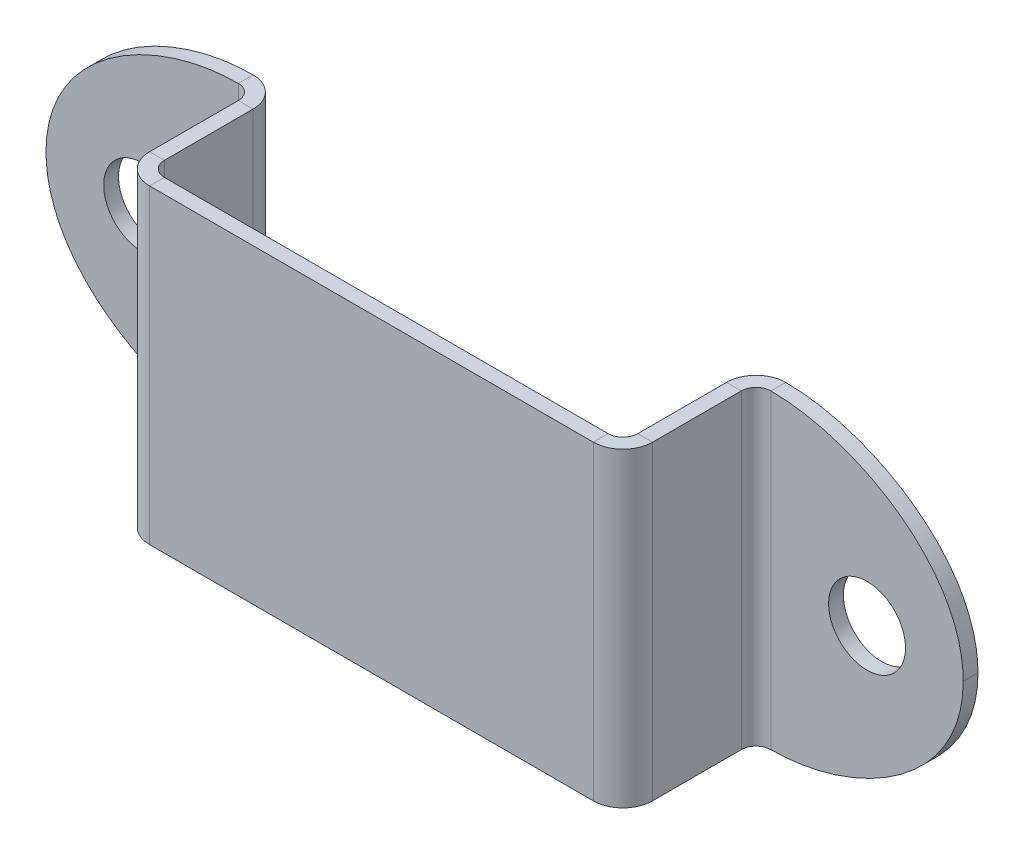
ISO-10303-21;
HEADER;
FILE_DESCRIPTION(('STEP AP214'),'2;1');
FILE_NAME('part.step','',(''),(''),'','','');
FILE_SCHEMA(('AUTOMOTIVE_DESIGN { 1 0 10303 214 1 1 1 1 }'));
ENDSEC;
DATA;
#1=APPLICATION_CONTEXT('core data for automotive mechanical design processes');
#2=APPLICATION_PROTOCOL_DEFINITION('international standard','automotive_design',2000,#1);
#3=PRODUCT_CONTEXT('',#1,'mechanical');
#4=PRODUCT('Part','Part','',(#3));
#5=PRODUCT_RELATED_PRODUCT_CATEGORY('part','',(#4));
#6=PRODUCT_DEFINITION_FORMATION('','',#4);
#7=PRODUCT_DEFINITION_CONTEXT('part definition',#1,'design');
#8=PRODUCT_DEFINITION('design','',#6,#7);
#9=PRODUCT_DEFINITION_SHAPE('','',#8);
#10=(LENGTH_UNIT() NAMED_UNIT(*) SI_UNIT(.MILLI.,.METRE.));
#11=(NAMED_UNIT(*) PLANE_ANGLE_UNIT() SI_UNIT($,.RADIAN.));
#12=(NAMED_UNIT(*) SI_UNIT($,.STERADIAN.) SOLID_ANGLE_UNIT());
#13=UNCERTAINTY_MEASURE_WITH_UNIT(LENGTH_MEASURE(1.E-05),#10,'distance_accuracy_value','');
#14=(GEOMETRIC_REPRESENTATION_CONTEXT(3) GLOBAL_UNCERTAINTY_ASSIGNED_CONTEXT((#13)) GLOBAL_UNIT_ASSIGNED_CONTEXT((#10,
#11,#12)) REPRESENTATION_CONTEXT('',''));
#15=CARTESIAN_POINT('',(0.,0.,0.));
#16=DIRECTION('',(0.,0.,1.));
#17=DIRECTION('',(1.,0.,0.));
#18=AXIS2_PLACEMENT_3D('',#15,#16,#17);
#19=CARTESIAN_POINT('',(16.,21.,1.));
#20=DIRECTION('',(0.,0.,-1.));
#21=DIRECTION('',(-1.,0.,0.));
#22=AXIS2_PLACEMENT_3D('',#19,#20,#21);
#23=PLANE('',#22);
#24=CARTESIAN_POINT('',(24.5,10.5,1.00000000000001));
#25=DIRECTION('',(0.,0.,1.));
#26=DIRECTION('',(-1.,0.,0.));
#27=AXIS2_PLACEMENT_3D('',#24,#25,#26);
#28=CIRCLE('',#27,2.6);
#29=CARTESIAN_POINT('',(21.9,10.5,1.00000000000001));
#30=VERTEX_POINT('',#29);
#31=EDGE_CURVE('E1026',#30,#30,#28,.T.);
#32=ORIENTED_EDGE('',*,*,#31,.F.);
#33=EDGE_LOOP('',(#32));
#34=FACE_BOUND('',#33,.T.);
#35=CARTESIAN_POINT('',(18.,21.,1.00000000000001));
#36=CARTESIAN_POINT('',(23.8406079071876,21.,1.00000000000001));
#37=CARTESIAN_POINT('',(31.,16.8315231890878,1.00000000000001));
#38=CARTESIAN_POINT('',(31.,10.5,1.00000000000001));
#39=B_SPLINE_CURVE_WITH_KNOTS('',3,(#35,#36,#37,#38),.UNSPECIFIED.,.F.,.F.,(4,4),(0.,1.),.UNSPECIFIED.);
#40=CARTESIAN_POINT('',(18.,21.,1.00000000000001));
#41=VERTEX_POINT('',#40);
#42=CARTESIAN_POINT('',(31.,10.5,1.00000000000001));
#43=VERTEX_POINT('',#42);
#44=EDGE_CURVE('E512',#41,#43,#39,.T.);
#45=ORIENTED_EDGE('',*,*,#44,.F.);
#46=DIRECTION('',(0.,-1.,0.));
#47=VECTOR('',#46,1.);
#48=CARTESIAN_POINT('',(18.,21.,0.999999999999999));
#49=LINE('',#48,#47);
#50=CARTESIAN_POINT('',(18.,0.,0.999999999999999));
#51=VERTEX_POINT('',#50);
#52=EDGE_CURVE('E219',#41,#51,#49,.T.);
#53=ORIENTED_EDGE('',*,*,#52,.T.);
#54=CARTESIAN_POINT('',(31.,10.5,1.00000000000001));
#55=CARTESIAN_POINT('',(31.,4.16847681091217,1.00000000000001));
#56=CARTESIAN_POINT('',(23.8406079071876,0.,1.00000000000001));
#57=CARTESIAN_POINT('',(18.,0.,1.00000000000001));
#58=B_SPLINE_CURVE_WITH_KNOTS('',3,(#54,#55,#56,#57),.UNSPECIFIED.,.F.,.F.,(4,4),(0.,1.),.UNSPECIFIED.);
#59=EDGE_CURVE('E128',#43,#51,#58,.T.);
#60=ORIENTED_EDGE('',*,*,#59,.F.);
#61=EDGE_LOOP('',(#45,#53,#60));
#62=FACE_BOUND('',#61,.T.);
#63=ADVANCED_FACE('F54',(#34,#62),#23,.F.);
#64=CARTESIAN_POINT('',(16.,21.,0.));
#65=DIRECTION('',(0.,0.,-1.));
#66=DIRECTION('',(-1.,0.,0.));
#67=AXIS2_PLACEMENT_3D('',#64,#65,#66);
#68=PLANE('',#67);
#69=CARTESIAN_POINT('',(24.5,10.5,0.));
#70=DIRECTION('',(0.,0.,1.));
#71=DIRECTION('',(-1.,0.,0.));
#72=AXIS2_PLACEMENT_3D('',#69,#70,#71);
#73=CIRCLE('',#72,2.6);
#74=CARTESIAN_POINT('',(21.9,10.5,0.));
#75=VERTEX_POINT('',#74);
#76=EDGE_CURVE('E1027',#75,#75,#73,.T.);
#77=ORIENTED_EDGE('',*,*,#76,.T.);
#78=EDGE_LOOP('',(#77));
#79=FACE_BOUND('',#78,.T.);
#80=DIRECTION('',(0.,-1.,0.));
#81=VECTOR('',#80,1.);
#82=CARTESIAN_POINT('',(18.,21.,0.));
#83=LINE('',#82,#81);
#84=CARTESIAN_POINT('',(18.,21.,0.));
#85=VERTEX_POINT('',#84);
#86=CARTESIAN_POINT('',(18.,0.,0.));
#87=VERTEX_POINT('',#86);
#88=EDGE_CURVE('E324',#85,#87,#83,.T.);
#89=ORIENTED_EDGE('',*,*,#88,.F.);
#90=CARTESIAN_POINT('',(18.,21.,0.));
#91=CARTESIAN_POINT('',(23.8406079071876,21.,0.));
#92=CARTESIAN_POINT('',(31.,16.8315231890878,0.));
#93=CARTESIAN_POINT('',(31.,10.5,0.));
#94=B_SPLINE_CURVE_WITH_KNOTS('',3,(#90,#91,#92,#93),.UNSPECIFIED.,.F.,.F.,(4,4),(0.,1.),.UNSPECIFIED.);
#95=CARTESIAN_POINT('',(31.,10.5,0.));
#96=VERTEX_POINT('',#95);
#97=EDGE_CURVE('E514',#85,#96,#94,.T.);
#98=ORIENTED_EDGE('',*,*,#97,.T.);
#99=CARTESIAN_POINT('',(31.,10.5,0.));
#100=CARTESIAN_POINT('',(31.,4.16847681091217,0.));
#101=CARTESIAN_POINT('',(23.8406079071876,0.,0.));
#102=CARTESIAN_POINT('',(18.,0.,0.));
#103=B_SPLINE_CURVE_WITH_KNOTS('',3,(#99,#100,#101,#102),.UNSPECIFIED.,.F.,.F.,(4,4),(0.,1.),.UNSPECIFIED.);
#104=EDGE_CURVE('E529',#96,#87,#103,.T.);
#105=ORIENTED_EDGE('',*,*,#104,.T.);
#106=EDGE_LOOP('',(#89,#98,#105));
#107=FACE_BOUND('',#106,.T.);
#108=ADVANCED_FACE('F531',(#79,#107),#68,.T.);
#109=CARTESIAN_POINT('',(-31.,21.,0.));
#110=DIRECTION('',(0.,0.,-1.));
#111=DIRECTION('',(-1.,0.,0.));
#112=AXIS2_PLACEMENT_3D('',#109,#110,#111);
#113=PLANE('',#112);
#114=CARTESIAN_POINT('',(-24.5,10.5,0.));
#115=DIRECTION('',(0.,0.,1.));
#116=DIRECTION('',(1.,0.,0.));
#117=AXIS2_PLACEMENT_3D('',#114,#115,#116);
#118=CIRCLE('',#117,2.6);
#119=CARTESIAN_POINT('',(-21.9,10.5,0.));
#120=VERTEX_POINT('',#119);
#121=EDGE_CURVE('E225',#120,#120,#118,.T.);
#122=ORIENTED_EDGE('',*,*,#121,.T.);
#123=EDGE_LOOP('',(#122));
#124=FACE_BOUND('',#123,.T.);
#125=CARTESIAN_POINT('',(-18.,0.,0.));
#126=CARTESIAN_POINT('',(-23.8406079071876,0.,0.));
#127=CARTESIAN_POINT('',(-31.,4.16847681091217,0.));
#128=CARTESIAN_POINT('',(-31.,10.5,0.));
#129=B_SPLINE_CURVE_WITH_KNOTS('',3,(#125,#126,#127,#128),.UNSPECIFIED.,.F.,.F.,(4,4),(0.,1.),.UNSPECIFIED.);
#130=CARTESIAN_POINT('',(-18.,0.,0.));
#131=VERTEX_POINT('',#130);
#132=CARTESIAN_POINT('',(-31.,10.5,0.));
#133=VERTEX_POINT('',#132);
#134=EDGE_CURVE('E390',#131,#133,#129,.T.);
#135=ORIENTED_EDGE('',*,*,#134,.T.);
#136=CARTESIAN_POINT('',(-31.,10.5,0.));
#137=CARTESIAN_POINT('',(-31.,16.8315231890878,0.));
#138=CARTESIAN_POINT('',(-23.8406079071876,21.,0.));
#139=CARTESIAN_POINT('',(-18.,21.,0.));
#140=B_SPLINE_CURVE_WITH_KNOTS('',3,(#136,#137,#138,#139),.UNSPECIFIED.,.F.,.F.,(4,4),(0.,1.),.UNSPECIFIED.);
#141=CARTESIAN_POINT('',(-18.,21.,0.));
#142=VERTEX_POINT('',#141);
#143=EDGE_CURVE('E374',#133,#142,#140,.T.);
#144=ORIENTED_EDGE('',*,*,#143,.T.);
#145=DIRECTION('',(0.,-1.,0.));
#146=VECTOR('',#145,1.);
#147=CARTESIAN_POINT('',(-18.,21.,0.));
#148=LINE('',#147,#146);
#149=EDGE_CURVE('E296',#142,#131,#148,.T.);
#150=ORIENTED_EDGE('',*,*,#149,.T.);
#151=EDGE_LOOP('',(#135,#144,#150));
#152=FACE_BOUND('',#151,.T.);
#153=ADVANCED_FACE('F387',(#124,#152),#113,.T.);
#154=CARTESIAN_POINT('',(-31.,21.,1.));
#155=DIRECTION('',(0.,0.,-1.));
#156=DIRECTION('',(-1.,0.,0.));
#157=AXIS2_PLACEMENT_3D('',#154,#155,#156);
#158=PLANE('',#157);
#159=CARTESIAN_POINT('',(-24.5,10.5,1.00000000000001));
#160=DIRECTION('',(0.,0.,1.));
#161=DIRECTION('',(1.,0.,0.));
#162=AXIS2_PLACEMENT_3D('',#159,#160,#161);
#163=CIRCLE('',#162,2.6);
#164=CARTESIAN_POINT('',(-21.9,10.5,1.00000000000001));
#165=VERTEX_POINT('',#164);
#166=EDGE_CURVE('E1031',#165,#165,#163,.T.);
#167=ORIENTED_EDGE('',*,*,#166,.F.);
#168=EDGE_LOOP('',(#167));
#169=FACE_BOUND('',#168,.T.);
#170=CARTESIAN_POINT('',(-31.,10.5,1.00000000000001));
#171=CARTESIAN_POINT('',(-31.,16.8315231890878,1.00000000000001));
#172=CARTESIAN_POINT('',(-23.8406079071876,21.,1.00000000000001));
#173=CARTESIAN_POINT('',(-18.,21.,1.00000000000001));
#174=B_SPLINE_CURVE_WITH_KNOTS('',3,(#170,#171,#172,#173),.UNSPECIFIED.,.F.,.F.,(4,4),(0.,1.),.UNSPECIFIED.);
#175=CARTESIAN_POINT('',(-31.,10.5,1.00000000000001));
#176=VERTEX_POINT('',#175);
#177=CARTESIAN_POINT('',(-18.,21.,1.));
#178=VERTEX_POINT('',#177);
#179=EDGE_CURVE('E378',#176,#178,#174,.T.);
#180=ORIENTED_EDGE('',*,*,#179,.F.);
#181=CARTESIAN_POINT('',(-18.,0.,1.00000000000001));
#182=CARTESIAN_POINT('',(-23.8406079071876,0.,1.00000000000001));
#183=CARTESIAN_POINT('',(-31.,4.16847681091217,1.00000000000001));
#184=CARTESIAN_POINT('',(-31.,10.5,1.00000000000001));
#185=B_SPLINE_CURVE_WITH_KNOTS('',3,(#181,#182,#183,#184),.UNSPECIFIED.,.F.,.F.,(4,4),(0.,1.),.UNSPECIFIED.);
#186=CARTESIAN_POINT('',(-18.,0.,1.));
#187=VERTEX_POINT('',#186);
#188=EDGE_CURVE('E484',#187,#176,#185,.T.);
#189=ORIENTED_EDGE('',*,*,#188,.F.);
#190=DIRECTION('',(0.,-1.,0.));
#191=VECTOR('',#190,1.);
#192=CARTESIAN_POINT('',(-18.,21.,1.));
#193=LINE('',#192,#191);
#194=EDGE_CURVE('E292',#178,#187,#193,.T.);
#195=ORIENTED_EDGE('',*,*,#194,.F.);
#196=EDGE_LOOP('',(#180,#189,#195));
#197=FACE_BOUND('',#196,.T.);
#198=ADVANCED_FACE('F486',(#169,#197),#158,.F.);
#199=CARTESIAN_POINT('',(-16.,21.,2.));
#200=DIRECTION('',(0.,1.,0.));
#201=DIRECTION('',(0.,0.,1.));
#202=AXIS2_PLACEMENT_3D('',#199,#200,#201);
#203=PLANE('',#202);
#204=DIRECTION('',(-1.,0.,0.));
#205=VECTOR('',#204,1.);
#206=CARTESIAN_POINT('',(-16.,21.,2.));
#207=LINE('',#206,#205);
#208=CARTESIAN_POINT('',(-16.,21.,2.));
#209=VERTEX_POINT('',#208);
#210=CARTESIAN_POINT('',(-17.,21.,2.));
#211=VERTEX_POINT('',#210);
#212=EDGE_CURVE('E13',#209,#211,#207,.T.);
#213=ORIENTED_EDGE('',*,*,#212,.F.);
#214=CARTESIAN_POINT('',(-18.,21.,2.));
#215=DIRECTION('',(0.,1.,0.));
#216=DIRECTION('',(0.,0.,1.));
#217=AXIS2_PLACEMENT_3D('',#214,#215,#216);
#218=CIRCLE('',#217,2.);
#219=EDGE_CURVE('E397',#142,#209,#218,.F.);
#220=ORIENTED_EDGE('',*,*,#219,.F.);
#221=DIRECTION('',(0.,0.,-1.));
#222=VECTOR('',#221,1.);
#223=CARTESIAN_POINT('',(-18.,21.,1.));
#224=LINE('',#223,#222);
#225=EDGE_CURVE('E64',#178,#142,#224,.T.);
#226=ORIENTED_EDGE('',*,*,#225,.F.);
#227=CARTESIAN_POINT('',(-18.,21.,2.));
#228=DIRECTION('',(0.,1.,0.));
#229=DIRECTION('',(1.,0.,0.));
#230=AXIS2_PLACEMENT_3D('',#227,#228,#229);
#231=CIRCLE('',#230,1.);
#232=EDGE_CURVE('E399',#178,#211,#231,.F.);
#233=ORIENTED_EDGE('',*,*,#232,.T.);
#234=EDGE_LOOP('',(#213,#220,#226,#233));
#235=FACE_BOUND('',#234,.T.);
#236=ADVANCED_FACE('F56',(#235),#203,.T.);
#237=CARTESIAN_POINT('',(-18.,21.,1.));
#238=DIRECTION('',(0.,1.,0.));
#239=DIRECTION('',(0.,0.,1.));
#240=AXIS2_PLACEMENT_3D('',#237,#238,#239);
#241=PLANE('',#240);
#242=DIRECTION('',(0.,0.,1.));
#243=VECTOR('',#242,1.);
#244=CARTESIAN_POINT('',(-16.,21.,0.));
#245=LINE('',#244,#243);
#246=CARTESIAN_POINT('',(-16.,21.,8.00000000000001));
#247=VERTEX_POINT('',#246);
#248=EDGE_CURVE('E400',#209,#247,#245,.T.);
#249=ORIENTED_EDGE('',*,*,#248,.F.);
#250=ORIENTED_EDGE('',*,*,#212,.T.);
#251=DIRECTION('',(0.,0.,-1.));
#252=VECTOR('',#251,1.);
#253=CARTESIAN_POINT('',(-17.,21.,0.));
#254=LINE('',#253,#252);
#255=CARTESIAN_POINT('',(-17.,21.,8.00000000000001));
#256=VERTEX_POINT('',#255);
#257=EDGE_CURVE('E402',#211,#256,#254,.F.);
#258=ORIENTED_EDGE('',*,*,#257,.T.);
#259=DIRECTION('',(1.,0.,0.));
#260=VECTOR('',#259,1.);
#261=CARTESIAN_POINT('',(-17.,21.,8.00000000000001));
#262=LINE('',#261,#260);
#263=EDGE_CURVE('E352',#256,#247,#262,.T.);
#264=ORIENTED_EDGE('',*,*,#263,.T.);
#265=EDGE_LOOP('',(#249,#250,#258,#264));
#266=FACE_BOUND('',#265,.T.);
#267=ADVANCED_FACE('F465',(#266),#241,.T.);
#268=CARTESIAN_POINT('',(-18.,0.,0.));
#269=DIRECTION('',(0.,-1.,0.));
#270=DIRECTION('',(0.,0.,-1.));
#271=AXIS2_PLACEMENT_3D('',#268,#269,#270);
#272=PLANE('',#271);
#273=DIRECTION('',(0.,0.,1.));
#274=VECTOR('',#273,1.);
#275=CARTESIAN_POINT('',(-18.,0.,0.));
#276=LINE('',#275,#274);
#277=EDGE_CURVE('E360',#131,#187,#276,.T.);
#278=ORIENTED_EDGE('',*,*,#277,.F.);
#279=CARTESIAN_POINT('',(-18.,0.,2.));
#280=DIRECTION('',(0.,1.,0.));
#281=DIRECTION('',(0.,0.,1.));
#282=AXIS2_PLACEMENT_3D('',#279,#280,#281);
#283=CIRCLE('',#282,2.);
#284=CARTESIAN_POINT('',(-16.,0.,2.));
#285=VERTEX_POINT('',#284);
#286=EDGE_CURVE('E244',#131,#285,#283,.F.);
#287=ORIENTED_EDGE('',*,*,#286,.T.);
#288=DIRECTION('',(1.,0.,0.));
#289=VECTOR('',#288,1.);
#290=CARTESIAN_POINT('',(-17.,0.,2.));
#291=LINE('',#290,#289);
#292=CARTESIAN_POINT('',(-17.,0.,2.));
#293=VERTEX_POINT('',#292);
#294=EDGE_CURVE('E357',#293,#285,#291,.T.);
#295=ORIENTED_EDGE('',*,*,#294,.F.);
#296=CARTESIAN_POINT('',(-18.,0.,2.));
#297=DIRECTION('',(0.,1.,0.));
#298=DIRECTION('',(1.,0.,0.));
#299=AXIS2_PLACEMENT_3D('',#296,#297,#298);
#300=CIRCLE('',#299,1.);
#301=EDGE_CURVE('E248',#187,#293,#300,.F.);
#302=ORIENTED_EDGE('',*,*,#301,.F.);
#303=EDGE_LOOP('',(#278,#287,#295,#302));
#304=FACE_BOUND('',#303,.T.);
#305=ADVANCED_FACE('F477',(#304),#272,.T.);
#306=CARTESIAN_POINT('',(-15.,21.,9.00000000000001));
#307=DIRECTION('',(0.,1.,0.));
#308=DIRECTION('',(0.,0.,1.));
#309=AXIS2_PLACEMENT_3D('',#306,#307,#308);
#310=PLANE('',#309);
#311=DIRECTION('',(0.,0.,1.));
#312=VECTOR('',#311,1.);
#313=CARTESIAN_POINT('',(-15.,21.,9.00000000000001));
#314=LINE('',#313,#312);
#315=CARTESIAN_POINT('',(-15.,21.,9.00000000000001));
#316=VERTEX_POINT('',#315);
#317=CARTESIAN_POINT('',(-15.,21.,10.));
#318=VERTEX_POINT('',#317);
#319=EDGE_CURVE('E184',#316,#318,#314,.T.);
#320=ORIENTED_EDGE('',*,*,#319,.F.);
#321=CARTESIAN_POINT('',(-15.,21.,8.00000000000001));
#322=DIRECTION('',(0.,-1.,0.));
#323=DIRECTION('',(0.,0.,-1.));
#324=AXIS2_PLACEMENT_3D('',#321,#322,#323);
#325=CIRCLE('',#324,1.);
#326=EDGE_CURVE('E406',#247,#316,#325,.F.);
#327=ORIENTED_EDGE('',*,*,#326,.F.);
#328=ORIENTED_EDGE('',*,*,#263,.F.);
#329=CARTESIAN_POINT('',(-15.,21.,8.00000000000001));
#330=DIRECTION('',(0.,1.,0.));
#331=DIRECTION('',(1.,0.,0.));
#332=AXIS2_PLACEMENT_3D('',#329,#330,#331);
#333=CIRCLE('',#332,2.);
#334=EDGE_CURVE('E189',#256,#318,#333,.T.);
#335=ORIENTED_EDGE('',*,*,#334,.T.);
#336=EDGE_LOOP('',(#320,#327,#328,#335));
#337=FACE_BOUND('',#336,.T.);
#338=ADVANCED_FACE('F418',(#337),#310,.T.);
#339=CARTESIAN_POINT('',(-17.,21.,8.00000000000001));
#340=DIRECTION('',(0.,1.,0.));
#341=DIRECTION('',(0.,0.,1.));
#342=AXIS2_PLACEMENT_3D('',#339,#340,#341);
#343=PLANE('',#342);
#344=DIRECTION('',(1.,0.,0.));
#345=VECTOR('',#344,1.);
#346=CARTESIAN_POINT('',(-16.,21.,9.00000000000001));
#347=LINE('',#346,#345);
#348=CARTESIAN_POINT('',(15.,21.,9.));
#349=VERTEX_POINT('',#348);
#350=EDGE_CURVE('E432',#316,#349,#347,.T.);
#351=ORIENTED_EDGE('',*,*,#350,.F.);
#352=ORIENTED_EDGE('',*,*,#319,.T.);
#353=DIRECTION('',(1.,0.,0.));
#354=VECTOR('',#353,1.);
#355=CARTESIAN_POINT('',(-16.,21.,10.));
#356=LINE('',#355,#354);
#357=CARTESIAN_POINT('',(15.,21.,10.));
#358=VERTEX_POINT('',#357);
#359=EDGE_CURVE('E181',#318,#358,#356,.T.);
#360=ORIENTED_EDGE('',*,*,#359,.T.);
#361=DIRECTION('',(0.,0.,-1.));
#362=VECTOR('',#361,1.);
#363=CARTESIAN_POINT('',(15.,21.,10.));
#364=LINE('',#363,#362);
#365=EDGE_CURVE('E164',#358,#349,#364,.T.);
#366=ORIENTED_EDGE('',*,*,#365,.T.);
#367=EDGE_LOOP('',(#351,#352,#360,#366));
#368=FACE_BOUND('',#367,.T.);
#369=ADVANCED_FACE('F183',(#368),#343,.T.);
#370=CARTESIAN_POINT('',(-16.,0.,8.00000000000001));
#371=DIRECTION('',(0.,-1.,0.));
#372=DIRECTION('',(0.,0.,-1.));
#373=AXIS2_PLACEMENT_3D('',#370,#371,#372);
#374=PLANE('',#373);
#375=DIRECTION('',(-1.,0.,0.));
#376=VECTOR('',#375,1.);
#377=CARTESIAN_POINT('',(-16.,0.,8.00000000000001));
#378=LINE('',#377,#376);
#379=CARTESIAN_POINT('',(-16.,0.,8.00000000000001));
#380=VERTEX_POINT('',#379);
#381=CARTESIAN_POINT('',(-17.,0.,8.00000000000001));
#382=VERTEX_POINT('',#381);
#383=EDGE_CURVE('E349',#380,#382,#378,.T.);
#384=ORIENTED_EDGE('',*,*,#383,.F.);
#385=CARTESIAN_POINT('',(-15.,0.,8.00000000000001));
#386=DIRECTION('',(0.,-1.,0.));
#387=DIRECTION('',(0.,0.,-1.));
#388=AXIS2_PLACEMENT_3D('',#385,#386,#387);
#389=CIRCLE('',#388,1.);
#390=CARTESIAN_POINT('',(-15.,0.,9.00000000000001));
#391=VERTEX_POINT('',#390);
#392=EDGE_CURVE('E236',#380,#391,#389,.F.);
#393=ORIENTED_EDGE('',*,*,#392,.T.);
#394=DIRECTION('',(0.,0.,-1.));
#395=VECTOR('',#394,1.);
#396=CARTESIAN_POINT('',(-15.,0.,10.));
#397=LINE('',#396,#395);
#398=CARTESIAN_POINT('',(-15.,0.,10.));
#399=VERTEX_POINT('',#398);
#400=EDGE_CURVE('E346',#399,#391,#397,.T.);
#401=ORIENTED_EDGE('',*,*,#400,.F.);
#402=CARTESIAN_POINT('',(-15.,0.,8.00000000000001));
#403=DIRECTION('',(0.,1.,0.));
#404=DIRECTION('',(1.,0.,0.));
#405=AXIS2_PLACEMENT_3D('',#402,#403,#404);
#406=CIRCLE('',#405,2.);
#407=EDGE_CURVE('E256',#382,#399,#406,.T.);
#408=ORIENTED_EDGE('',*,*,#407,.F.);
#409=EDGE_LOOP('',(#384,#393,#401,#408));
#410=FACE_BOUND('',#409,.T.);
#411=ADVANCED_FACE('F472',(#410),#374,.T.);
#412=CARTESIAN_POINT('',(-15.,0.,10.));
#413=DIRECTION('',(0.,-1.,0.));
#414=DIRECTION('',(0.,0.,-1.));
#415=AXIS2_PLACEMENT_3D('',#412,#413,#414);
#416=PLANE('',#415);
#417=DIRECTION('',(0.,0.,1.));
#418=VECTOR('',#417,1.);
#419=CARTESIAN_POINT('',(-16.,0.,0.));
#420=LINE('',#419,#418);
#421=EDGE_CURVE('E240',#285,#380,#420,.T.);
#422=ORIENTED_EDGE('',*,*,#421,.T.);
#423=ORIENTED_EDGE('',*,*,#383,.T.);
#424=DIRECTION('',(0.,0.,-1.));
#425=VECTOR('',#424,1.);
#426=CARTESIAN_POINT('',(-17.,0.,0.));
#427=LINE('',#426,#425);
#428=EDGE_CURVE('E252',#293,#382,#427,.F.);
#429=ORIENTED_EDGE('',*,*,#428,.F.);
#430=ORIENTED_EDGE('',*,*,#294,.T.);
#431=EDGE_LOOP('',(#422,#423,#429,#430));
#432=FACE_BOUND('',#431,.T.);
#433=ADVANCED_FACE('F474',(#432),#416,.T.);
#434=CARTESIAN_POINT('',(16.,21.,8.));
#435=DIRECTION('',(0.,1.,0.));
#436=DIRECTION('',(0.,0.,1.));
#437=AXIS2_PLACEMENT_3D('',#434,#435,#436);
#438=PLANE('',#437);
#439=DIRECTION('',(1.,0.,0.));
#440=VECTOR('',#439,1.);
#441=CARTESIAN_POINT('',(16.,21.,8.));
#442=LINE('',#441,#440);
#443=CARTESIAN_POINT('',(16.,21.,8.));
#444=VERTEX_POINT('',#443);
#445=CARTESIAN_POINT('',(17.,21.,8.));
#446=VERTEX_POINT('',#445);
#447=EDGE_CURVE('E177',#444,#446,#442,.T.);
#448=ORIENTED_EDGE('',*,*,#447,.F.);
#449=CARTESIAN_POINT('',(15.,21.,8.));
#450=DIRECTION('',(0.,-1.,0.));
#451=DIRECTION('',(0.,0.,-1.));
#452=AXIS2_PLACEMENT_3D('',#449,#450,#451);
#453=CIRCLE('',#452,1.);
#454=EDGE_CURVE('E171',#349,#444,#453,.F.);
#455=ORIENTED_EDGE('',*,*,#454,.F.);
#456=ORIENTED_EDGE('',*,*,#365,.F.);
#457=CARTESIAN_POINT('',(15.,21.,8.));
#458=DIRECTION('',(0.,1.,0.));
#459=DIRECTION('',(1.,0.,0.));
#460=AXIS2_PLACEMENT_3D('',#457,#458,#459);
#461=CIRCLE('',#460,2.);
#462=EDGE_CURVE('E168',#358,#446,#461,.T.);
#463=ORIENTED_EDGE('',*,*,#462,.T.);
#464=EDGE_LOOP('',(#448,#455,#456,#463));
#465=FACE_BOUND('',#464,.T.);
#466=ADVANCED_FACE('F166',(#465),#438,.T.);
#467=CARTESIAN_POINT('',(15.,21.,10.));
#468=DIRECTION('',(0.,1.,0.));
#469=DIRECTION('',(0.,0.,1.));
#470=AXIS2_PLACEMENT_3D('',#467,#468,#469);
#471=PLANE('',#470);
#472=DIRECTION('',(0.,0.,-1.));
#473=VECTOR('',#472,1.);
#474=CARTESIAN_POINT('',(16.,21.,9.));
#475=LINE('',#474,#473);
#476=CARTESIAN_POINT('',(16.,21.,2.));
#477=VERTEX_POINT('',#476);
#478=EDGE_CURVE('E447',#444,#477,#475,.T.);
#479=ORIENTED_EDGE('',*,*,#478,.F.);
#480=ORIENTED_EDGE('',*,*,#447,.T.);
#481=DIRECTION('',(0.,0.,-1.));
#482=VECTOR('',#481,1.);
#483=CARTESIAN_POINT('',(17.,21.,9.));
#484=LINE('',#483,#482);
#485=CARTESIAN_POINT('',(17.,21.,2.));
#486=VERTEX_POINT('',#485);
#487=EDGE_CURVE('E208',#446,#486,#484,.T.);
#488=ORIENTED_EDGE('',*,*,#487,.T.);
#489=DIRECTION('',(-1.,0.,0.));
#490=VECTOR('',#489,1.);
#491=CARTESIAN_POINT('',(17.,21.,2.));
#492=LINE('',#491,#490);
#493=EDGE_CURVE('E72',#486,#477,#492,.T.);
#494=ORIENTED_EDGE('',*,*,#493,.T.);
#495=EDGE_LOOP('',(#479,#480,#488,#494));
#496=FACE_BOUND('',#495,.T.);
#497=ADVANCED_FACE('F446',(#496),#471,.T.);
#498=CARTESIAN_POINT('',(15.,0.,9.));
#499=DIRECTION('',(0.,-1.,0.));
#500=DIRECTION('',(0.,0.,-1.));
#501=AXIS2_PLACEMENT_3D('',#498,#499,#500);
#502=PLANE('',#501);
#503=DIRECTION('',(0.,0.,1.));
#504=VECTOR('',#503,1.);
#505=CARTESIAN_POINT('',(15.,0.,9.));
#506=LINE('',#505,#504);
#507=CARTESIAN_POINT('',(15.,0.,9.));
#508=VERTEX_POINT('',#507);
#509=CARTESIAN_POINT('',(15.,0.,10.));
#510=VERTEX_POINT('',#509);
#511=EDGE_CURVE('E178',#508,#510,#506,.T.);
#512=ORIENTED_EDGE('',*,*,#511,.F.);
#513=CARTESIAN_POINT('',(15.,0.,8.));
#514=DIRECTION('',(0.,-1.,0.));
#515=DIRECTION('',(0.,0.,-1.));
#516=AXIS2_PLACEMENT_3D('',#513,#514,#515);
#517=CIRCLE('',#516,1.);
#518=CARTESIAN_POINT('',(16.,0.,8.));
#519=VERTEX_POINT('',#518);
#520=EDGE_CURVE('E228',#508,#519,#517,.F.);
#521=ORIENTED_EDGE('',*,*,#520,.T.);
#522=DIRECTION('',(-1.,0.,0.));
#523=VECTOR('',#522,1.);
#524=CARTESIAN_POINT('',(17.,0.,8.));
#525=LINE('',#524,#523);
#526=CARTESIAN_POINT('',(17.,0.,8.));
#527=VERTEX_POINT('',#526);
#528=EDGE_CURVE('E339',#527,#519,#525,.T.);
#529=ORIENTED_EDGE('',*,*,#528,.F.);
#530=CARTESIAN_POINT('',(15.,0.,8.));
#531=DIRECTION('',(0.,1.,0.));
#532=DIRECTION('',(1.,0.,0.));
#533=AXIS2_PLACEMENT_3D('',#530,#531,#532);
#534=CIRCLE('',#533,2.);
#535=EDGE_CURVE('E262',#510,#527,#534,.T.);
#536=ORIENTED_EDGE('',*,*,#535,.F.);
#537=EDGE_LOOP('',(#512,#521,#529,#536));
#538=FACE_BOUND('',#537,.T.);
#539=ADVANCED_FACE('F428',(#538),#502,.T.);
#540=CARTESIAN_POINT('',(17.,0.,8.));
#541=DIRECTION('',(0.,-1.,0.));
#542=DIRECTION('',(0.,0.,-1.));
#543=AXIS2_PLACEMENT_3D('',#540,#541,#542);
#544=PLANE('',#543);
#545=DIRECTION('',(1.,0.,0.));
#546=VECTOR('',#545,1.);
#547=CARTESIAN_POINT('',(-16.,0.,9.00000000000001));
#548=LINE('',#547,#546);
#549=EDGE_CURVE('E232',#391,#508,#548,.T.);
#550=ORIENTED_EDGE('',*,*,#549,.T.);
#551=ORIENTED_EDGE('',*,*,#511,.T.);
#552=DIRECTION('',(1.,0.,0.));
#553=VECTOR('',#552,1.);
#554=CARTESIAN_POINT('',(-16.,0.,10.));
#555=LINE('',#554,#553);
#556=EDGE_CURVE('E196',#399,#510,#555,.T.);
#557=ORIENTED_EDGE('',*,*,#556,.F.);
#558=ORIENTED_EDGE('',*,*,#400,.T.);
#559=EDGE_LOOP('',(#550,#551,#557,#558));
#560=FACE_BOUND('',#559,.T.);
#561=ADVANCED_FACE('F425',(#560),#544,.T.);
#562=CARTESIAN_POINT('',(18.,21.,0.));
#563=DIRECTION('',(0.,1.,0.));
#564=DIRECTION('',(0.,0.,1.));
#565=AXIS2_PLACEMENT_3D('',#562,#563,#564);
#566=PLANE('',#565);
#567=DIRECTION('',(0.,0.,1.));
#568=VECTOR('',#567,1.);
#569=CARTESIAN_POINT('',(18.,21.,0.));
#570=LINE('',#569,#568);
#571=EDGE_CURVE('E335',#85,#41,#570,.T.);
#572=ORIENTED_EDGE('',*,*,#571,.F.);
#573=CARTESIAN_POINT('',(18.,21.,2.));
#574=DIRECTION('',(0.,1.,0.));
#575=DIRECTION('',(0.,0.,1.));
#576=AXIS2_PLACEMENT_3D('',#573,#574,#575);
#577=CIRCLE('',#576,2.);
#578=EDGE_CURVE('E272',#477,#85,#577,.F.);
#579=ORIENTED_EDGE('',*,*,#578,.F.);
#580=ORIENTED_EDGE('',*,*,#493,.F.);
#581=CARTESIAN_POINT('',(18.,21.,2.));
#582=DIRECTION('',(0.,1.,0.));
#583=DIRECTION('',(1.,0.,0.));
#584=AXIS2_PLACEMENT_3D('',#581,#582,#583);
#585=CIRCLE('',#584,1.);
#586=EDGE_CURVE('E213',#486,#41,#585,.F.);
#587=ORIENTED_EDGE('',*,*,#586,.T.);
#588=EDGE_LOOP('',(#572,#579,#580,#587));
#589=FACE_BOUND('',#588,.T.);
#590=ADVANCED_FACE('F520',(#589),#566,.T.);
#591=CARTESIAN_POINT('',(16.,0.,2.));
#592=DIRECTION('',(0.,-1.,0.));
#593=DIRECTION('',(0.,0.,-1.));
#594=AXIS2_PLACEMENT_3D('',#591,#592,#593);
#595=PLANE('',#594);
#596=DIRECTION('',(1.,0.,0.));
#597=VECTOR('',#596,1.);
#598=CARTESIAN_POINT('',(16.,0.,2.));
#599=LINE('',#598,#597);
#600=CARTESIAN_POINT('',(16.,0.,2.));
#601=VERTEX_POINT('',#600);
#602=CARTESIAN_POINT('',(17.,0.,2.));
#603=VERTEX_POINT('',#602);
#604=EDGE_CURVE('E120',#601,#603,#599,.T.);
#605=ORIENTED_EDGE('',*,*,#604,.F.);
#606=CARTESIAN_POINT('',(18.,0.,2.));
#607=DIRECTION('',(0.,1.,0.));
#608=DIRECTION('',(0.,0.,1.));
#609=AXIS2_PLACEMENT_3D('',#606,#607,#608);
#610=CIRCLE('',#609,2.);
#611=EDGE_CURVE('E220',#601,#87,#610,.F.);
#612=ORIENTED_EDGE('',*,*,#611,.T.);
#613=DIRECTION('',(0.,0.,-1.));
#614=VECTOR('',#613,1.);
#615=CARTESIAN_POINT('',(18.,0.,0.999999999999999));
#616=LINE('',#615,#614);
#617=EDGE_CURVE('E328',#51,#87,#616,.T.);
#618=ORIENTED_EDGE('',*,*,#617,.F.);
#619=CARTESIAN_POINT('',(18.,0.,2.));
#620=DIRECTION('',(0.,1.,0.));
#621=DIRECTION('',(1.,0.,0.));
#622=AXIS2_PLACEMENT_3D('',#619,#620,#621);
#623=CIRCLE('',#622,1.);
#624=EDGE_CURVE('E268',#603,#51,#623,.F.);
#625=ORIENTED_EDGE('',*,*,#624,.F.);
#626=EDGE_LOOP('',(#605,#612,#618,#625));
#627=FACE_BOUND('',#626,.T.);
#628=ADVANCED_FACE('F525',(#627),#595,.T.);
#629=CARTESIAN_POINT('',(18.,0.,0.999999999999999));
#630=DIRECTION('',(0.,-1.,0.));
#631=DIRECTION('',(0.,0.,-1.));
#632=AXIS2_PLACEMENT_3D('',#629,#630,#631);
#633=PLANE('',#632);
#634=DIRECTION('',(0.,0.,-1.));
#635=VECTOR('',#634,1.);
#636=CARTESIAN_POINT('',(16.,0.,9.));
#637=LINE('',#636,#635);
#638=EDGE_CURVE('E224',#519,#601,#637,.T.);
#639=ORIENTED_EDGE('',*,*,#638,.T.);
#640=ORIENTED_EDGE('',*,*,#604,.T.);
#641=DIRECTION('',(0.,0.,-1.));
#642=VECTOR('',#641,1.);
#643=CARTESIAN_POINT('',(17.,0.,9.));
#644=LINE('',#643,#642);
#645=EDGE_CURVE('E265',#527,#603,#644,.T.);
#646=ORIENTED_EDGE('',*,*,#645,.F.);
#647=ORIENTED_EDGE('',*,*,#528,.T.);
#648=EDGE_LOOP('',(#639,#640,#646,#647));
#649=FACE_BOUND('',#648,.T.);
#650=ADVANCED_FACE('F441',(#649),#633,.T.);
#651=CARTESIAN_POINT('',(18.,21.,2.));
#652=DIRECTION('',(0.,-1.,0.));
#653=DIRECTION('',(0.,0.,-1.));
#654=AXIS2_PLACEMENT_3D('',#651,#652,#653);
#655=CYLINDRICAL_SURFACE('',#654,2.);
#656=ORIENTED_EDGE('',*,*,#611,.F.);
#657=DIRECTION('',(0.,-1.,0.));
#658=VECTOR('',#657,1.);
#659=CARTESIAN_POINT('',(16.,21.,2.));
#660=LINE('',#659,#658);
#661=EDGE_CURVE('E320',#477,#601,#660,.T.);
#662=ORIENTED_EDGE('',*,*,#661,.F.);
#663=ORIENTED_EDGE('',*,*,#578,.T.);
#664=ORIENTED_EDGE('',*,*,#88,.T.);
#665=EDGE_LOOP('',(#656,#662,#663,#664));
#666=FACE_BOUND('',#665,.T.);
#667=ADVANCED_FACE('F535',(#666),#655,.T.);
#668=CARTESIAN_POINT('',(16.,21.,9.));
#669=DIRECTION('',(-1.,0.,0.));
#670=DIRECTION('',(0.,0.,1.));
#671=AXIS2_PLACEMENT_3D('',#668,#669,#670);
#672=PLANE('',#671);
#673=ORIENTED_EDGE('',*,*,#638,.F.);
#674=DIRECTION('',(0.,-1.,0.));
#675=VECTOR('',#674,1.);
#676=CARTESIAN_POINT('',(16.,21.,8.));
#677=LINE('',#676,#675);
#678=EDGE_CURVE('E316',#444,#519,#677,.T.);
#679=ORIENTED_EDGE('',*,*,#678,.F.);
#680=ORIENTED_EDGE('',*,*,#478,.T.);
#681=ORIENTED_EDGE('',*,*,#661,.T.);
#682=EDGE_LOOP('',(#673,#679,#680,#681));
#683=FACE_BOUND('',#682,.T.);
#684=ADVANCED_FACE('F439',(#683),#672,.T.);
#685=CARTESIAN_POINT('',(15.,21.,8.));
#686=DIRECTION('',(0.,-1.,0.));
#687=DIRECTION('',(0.,0.,-1.));
#688=AXIS2_PLACEMENT_3D('',#685,#686,#687);
#689=CYLINDRICAL_SURFACE('',#688,1.);
#690=ORIENTED_EDGE('',*,*,#520,.F.);
#691=DIRECTION('',(0.,-1.,0.));
#692=VECTOR('',#691,1.);
#693=CARTESIAN_POINT('',(15.,21.,9.));
#694=LINE('',#693,#692);
#695=EDGE_CURVE('E312',#349,#508,#694,.T.);
#696=ORIENTED_EDGE('',*,*,#695,.F.);
#697=ORIENTED_EDGE('',*,*,#454,.T.);
#698=ORIENTED_EDGE('',*,*,#678,.T.);
#699=EDGE_LOOP('',(#690,#696,#697,#698));
#700=FACE_BOUND('',#699,.T.);
#701=ADVANCED_FACE('F434',(#700),#689,.F.);
#702=CARTESIAN_POINT('',(-16.,21.,9.00000000000001));
#703=DIRECTION('',(0.,0.,-1.));
#704=DIRECTION('',(-1.,0.,0.));
#705=AXIS2_PLACEMENT_3D('',#702,#703,#704);
#706=PLANE('',#705);
#707=ORIENTED_EDGE('',*,*,#549,.F.);
#708=DIRECTION('',(0.,-1.,0.));
#709=VECTOR('',#708,1.);
#710=CARTESIAN_POINT('',(-15.,21.,9.00000000000001));
#711=LINE('',#710,#709);
#712=EDGE_CURVE('E308',#316,#391,#711,.T.);
#713=ORIENTED_EDGE('',*,*,#712,.F.);
#714=ORIENTED_EDGE('',*,*,#350,.T.);
#715=ORIENTED_EDGE('',*,*,#695,.T.);
#716=EDGE_LOOP('',(#707,#713,#714,#715));
#717=FACE_BOUND('',#716,.T.);
#718=ADVANCED_FACE('F431',(#717),#706,.T.);
#719=CARTESIAN_POINT('',(-15.,21.,8.00000000000001));
#720=DIRECTION('',(0.,-1.,0.));
#721=DIRECTION('',(0.,0.,-1.));
#722=AXIS2_PLACEMENT_3D('',#719,#720,#721);
#723=CYLINDRICAL_SURFACE('',#722,1.);
#724=ORIENTED_EDGE('',*,*,#392,.F.);
#725=DIRECTION('',(0.,-1.,0.));
#726=VECTOR('',#725,1.);
#727=CARTESIAN_POINT('',(-16.,21.,8.00000000000001));
#728=LINE('',#727,#726);
#729=EDGE_CURVE('E304',#247,#380,#728,.T.);
#730=ORIENTED_EDGE('',*,*,#729,.F.);
#731=ORIENTED_EDGE('',*,*,#326,.T.);
#732=ORIENTED_EDGE('',*,*,#712,.T.);
#733=EDGE_LOOP('',(#724,#730,#731,#732));
#734=FACE_BOUND('',#733,.T.);
#735=ADVANCED_FACE('F459',(#734),#723,.F.);
#736=CARTESIAN_POINT('',(-16.,21.,0.));
#737=DIRECTION('',(1.,0.,0.));
#738=DIRECTION('',(0.,0.,-1.));
#739=AXIS2_PLACEMENT_3D('',#736,#737,#738);
#740=PLANE('',#739);
#741=ORIENTED_EDGE('',*,*,#421,.F.);
#742=DIRECTION('',(0.,-1.,0.));
#743=VECTOR('',#742,1.);
#744=CARTESIAN_POINT('',(-16.,21.,2.));
#745=LINE('',#744,#743);
#746=EDGE_CURVE('E300',#209,#285,#745,.T.);
#747=ORIENTED_EDGE('',*,*,#746,.F.);
#748=ORIENTED_EDGE('',*,*,#248,.T.);
#749=ORIENTED_EDGE('',*,*,#729,.T.);
#750=EDGE_LOOP('',(#741,#747,#748,#749));
#751=FACE_BOUND('',#750,.T.);
#752=ADVANCED_FACE('F463',(#751),#740,.T.);
#753=CARTESIAN_POINT('',(-18.,21.,2.));
#754=DIRECTION('',(0.,-1.,0.));
#755=DIRECTION('',(0.,0.,-1.));
#756=AXIS2_PLACEMENT_3D('',#753,#754,#755);
#757=CYLINDRICAL_SURFACE('',#756,2.);
#758=ORIENTED_EDGE('',*,*,#286,.F.);
#759=ORIENTED_EDGE('',*,*,#149,.F.);
#760=ORIENTED_EDGE('',*,*,#219,.T.);
#761=ORIENTED_EDGE('',*,*,#746,.T.);
#762=EDGE_LOOP('',(#758,#759,#760,#761));
#763=FACE_BOUND('',#762,.T.);
#764=ADVANCED_FACE('F396',(#763),#757,.T.);
#765=CARTESIAN_POINT('',(-18.,21.,2.));
#766=DIRECTION('',(0.,-1.,0.));
#767=DIRECTION('',(0.,0.,-1.));
#768=AXIS2_PLACEMENT_3D('',#765,#766,#767);
#769=CYLINDRICAL_SURFACE('',#768,1.);
#770=ORIENTED_EDGE('',*,*,#301,.T.);
#771=DIRECTION('',(0.,-1.,0.));
#772=VECTOR('',#771,1.);
#773=CARTESIAN_POINT('',(-17.,21.,2.));
#774=LINE('',#773,#772);
#775=EDGE_CURVE('E288',#211,#293,#774,.T.);
#776=ORIENTED_EDGE('',*,*,#775,.F.);
#777=ORIENTED_EDGE('',*,*,#232,.F.);
#778=ORIENTED_EDGE('',*,*,#194,.T.);
#779=EDGE_LOOP('',(#770,#776,#777,#778));
#780=FACE_BOUND('',#779,.T.);
#781=ADVANCED_FACE('F491',(#780),#769,.F.);
#782=CARTESIAN_POINT('',(-17.,21.,0.));
#783=DIRECTION('',(1.,0.,0.));
#784=DIRECTION('',(0.,0.,-1.));
#785=AXIS2_PLACEMENT_3D('',#782,#783,#784);
#786=PLANE('',#785);
#787=ORIENTED_EDGE('',*,*,#428,.T.);
#788=DIRECTION('',(0.,-1.,0.));
#789=VECTOR('',#788,1.);
#790=CARTESIAN_POINT('',(-17.,21.,8.00000000000001));
#791=LINE('',#790,#789);
#792=EDGE_CURVE('E284',#256,#382,#791,.T.);
#793=ORIENTED_EDGE('',*,*,#792,.F.);
#794=ORIENTED_EDGE('',*,*,#257,.F.);
#795=ORIENTED_EDGE('',*,*,#775,.T.);
#796=EDGE_LOOP('',(#787,#793,#794,#795));
#797=FACE_BOUND('',#796,.T.);
#798=ADVANCED_FACE('F469',(#797),#786,.F.);
#799=CARTESIAN_POINT('',(-15.,21.,8.00000000000001));
#800=DIRECTION('',(0.,-1.,0.));
#801=DIRECTION('',(0.,0.,-1.));
#802=AXIS2_PLACEMENT_3D('',#799,#800,#801);
#803=CYLINDRICAL_SURFACE('',#802,2.);
#804=ORIENTED_EDGE('',*,*,#407,.T.);
#805=DIRECTION('',(0.,-1.,0.));
#806=VECTOR('',#805,1.);
#807=CARTESIAN_POINT('',(-15.,21.,10.));
#808=LINE('',#807,#806);
#809=EDGE_CURVE('E201',#318,#399,#808,.T.);
#810=ORIENTED_EDGE('',*,*,#809,.F.);
#811=ORIENTED_EDGE('',*,*,#334,.F.);
#812=ORIENTED_EDGE('',*,*,#792,.T.);
#813=EDGE_LOOP('',(#804,#810,#811,#812));
#814=FACE_BOUND('',#813,.T.);
#815=ADVANCED_FACE('F422',(#814),#803,.T.);
#816=CARTESIAN_POINT('',(-16.,21.,10.));
#817=DIRECTION('',(0.,0.,-1.));
#818=DIRECTION('',(-1.,0.,0.));
#819=AXIS2_PLACEMENT_3D('',#816,#817,#818);
#820=PLANE('',#819);
#821=ORIENTED_EDGE('',*,*,#556,.T.);
#822=DIRECTION('',(0.,-1.,0.));
#823=VECTOR('',#822,1.);
#824=CARTESIAN_POINT('',(15.,21.,10.));
#825=LINE('',#824,#823);
#826=EDGE_CURVE('E193',#358,#510,#825,.T.);
#827=ORIENTED_EDGE('',*,*,#826,.F.);
#828=ORIENTED_EDGE('',*,*,#359,.F.);
#829=ORIENTED_EDGE('',*,*,#809,.T.);
#830=EDGE_LOOP('',(#821,#827,#828,#829));
#831=FACE_BOUND('',#830,.T.);
#832=ADVANCED_FACE('F194',(#831),#820,.F.);
#833=CARTESIAN_POINT('',(15.,21.,8.));
#834=DIRECTION('',(0.,-1.,0.));
#835=DIRECTION('',(0.,0.,-1.));
#836=AXIS2_PLACEMENT_3D('',#833,#834,#835);
#837=CYLINDRICAL_SURFACE('',#836,2.);
#838=ORIENTED_EDGE('',*,*,#535,.T.);
#839=DIRECTION('',(0.,-1.,0.));
#840=VECTOR('',#839,1.);
#841=CARTESIAN_POINT('',(17.,21.,8.));
#842=LINE('',#841,#840);
#843=EDGE_CURVE('E202',#446,#527,#842,.T.);
#844=ORIENTED_EDGE('',*,*,#843,.F.);
#845=ORIENTED_EDGE('',*,*,#462,.F.);
#846=ORIENTED_EDGE('',*,*,#826,.T.);
#847=EDGE_LOOP('',(#838,#844,#845,#846));
#848=FACE_BOUND('',#847,.T.);
#849=ADVANCED_FACE('F204',(#848),#837,.T.);
#850=CARTESIAN_POINT('',(17.,21.,9.));
#851=DIRECTION('',(-1.,0.,0.));
#852=DIRECTION('',(0.,0.,1.));
#853=AXIS2_PLACEMENT_3D('',#850,#851,#852);
#854=PLANE('',#853);
#855=ORIENTED_EDGE('',*,*,#645,.T.);
#856=DIRECTION('',(0.,-1.,0.));
#857=VECTOR('',#856,1.);
#858=CARTESIAN_POINT('',(17.,21.,2.));
#859=LINE('',#858,#857);
#860=EDGE_CURVE('E276',#486,#603,#859,.T.);
#861=ORIENTED_EDGE('',*,*,#860,.F.);
#862=ORIENTED_EDGE('',*,*,#487,.F.);
#863=ORIENTED_EDGE('',*,*,#843,.T.);
#864=EDGE_LOOP('',(#855,#861,#862,#863));
#865=FACE_BOUND('',#864,.T.);
#866=ADVANCED_FACE('F443',(#865),#854,.F.);
#867=CARTESIAN_POINT('',(18.,21.,2.));
#868=DIRECTION('',(0.,-1.,0.));
#869=DIRECTION('',(0.,0.,-1.));
#870=AXIS2_PLACEMENT_3D('',#867,#868,#869);
#871=CYLINDRICAL_SURFACE('',#870,1.);
#872=ORIENTED_EDGE('',*,*,#624,.T.);
#873=ORIENTED_EDGE('',*,*,#52,.F.);
#874=ORIENTED_EDGE('',*,*,#586,.F.);
#875=ORIENTED_EDGE('',*,*,#860,.T.);
#876=EDGE_LOOP('',(#872,#873,#874,#875));
#877=FACE_BOUND('',#876,.T.);
#878=ADVANCED_FACE('F522',(#877),#871,.F.);
#879=CARTESIAN_POINT('',(-24.5,10.5,0.));
#880=DIRECTION('',(0.,0.,1.));
#881=DIRECTION('',(1.,0.,0.));
#882=AXIS2_PLACEMENT_3D('',#879,#880,#881);
#883=CYLINDRICAL_SURFACE('',#882,2.6);
#884=ORIENTED_EDGE('',*,*,#121,.F.);
#885=EDGE_LOOP('',(#884));
#886=FACE_BOUND('',#885,.T.);
#887=ORIENTED_EDGE('',*,*,#166,.T.);
#888=EDGE_LOOP('',(#887));
#889=FACE_BOUND('',#888,.T.);
#890=ADVANCED_FACE('F651',(#886,#889),#883,.F.);
#891=CARTESIAN_POINT('',(24.5,10.5,0.));
#892=DIRECTION('',(0.,0.,1.));
#893=DIRECTION('',(1.,0.,0.));
#894=AXIS2_PLACEMENT_3D('',#891,#892,#893);
#895=CYLINDRICAL_SURFACE('',#894,2.6);
#896=ORIENTED_EDGE('',*,*,#76,.F.);
#897=EDGE_LOOP('',(#896));
#898=FACE_BOUND('',#897,.T.);
#899=ORIENTED_EDGE('',*,*,#31,.T.);
#900=EDGE_LOOP('',(#899));
#901=FACE_BOUND('',#900,.T.);
#902=ADVANCED_FACE('F657',(#898,#901),#895,.F.);
#903=CARTESIAN_POINT('',(-18.,0.,1.00000000000001));
#904=CARTESIAN_POINT('',(-23.8406079071876,0.,1.00000000000001));
#905=CARTESIAN_POINT('',(-31.,4.16847681091217,1.00000000000001));
#906=CARTESIAN_POINT('',(-31.,10.5,1.00000000000001));
#907=B_SPLINE_CURVE_WITH_KNOTS('',3,(#903,#904,#905,#906),.UNSPECIFIED.,.F.,.F.,(4,4),(0.,1.),.UNSPECIFIED.);
#908=DIRECTION('',(0.,0.,-1.));
#909=VECTOR('',#908,1.);
#910=SURFACE_OF_LINEAR_EXTRUSION('',#907,#909);
#911=ORIENTED_EDGE('',*,*,#277,.T.);
#912=ORIENTED_EDGE('',*,*,#188,.T.);
#913=DIRECTION('',(0.,0.,1.));
#914=VECTOR('',#913,1.);
#915=CARTESIAN_POINT('',(-31.,10.5,1.));
#916=LINE('',#915,#914);
#917=EDGE_CURVE('E1020',#176,#133,#916,.F.);
#918=ORIENTED_EDGE('',*,*,#917,.T.);
#919=ORIENTED_EDGE('',*,*,#134,.F.);
#920=EDGE_LOOP('',(#911,#912,#918,#919));
#921=FACE_BOUND('',#920,.T.);
#922=ADVANCED_FACE('F482',(#921),#910,.T.);
#923=CARTESIAN_POINT('',(-31.,10.5,1.00000000000001));
#924=CARTESIAN_POINT('',(-31.,16.8315231890878,1.00000000000001));
#925=CARTESIAN_POINT('',(-23.8406079071876,21.,1.00000000000001));
#926=CARTESIAN_POINT('',(-18.,21.,1.00000000000001));
#927=B_SPLINE_CURVE_WITH_KNOTS('',3,(#923,#924,#925,#926),.UNSPECIFIED.,.F.,.F.,(4,4),(0.,1.),.UNSPECIFIED.);
#928=DIRECTION('',(0.,0.,-1.));
#929=VECTOR('',#928,1.);
#930=SURFACE_OF_LINEAR_EXTRUSION('',#927,#929);
#931=ORIENTED_EDGE('',*,*,#917,.F.);
#932=ORIENTED_EDGE('',*,*,#179,.T.);
#933=ORIENTED_EDGE('',*,*,#225,.T.);
#934=ORIENTED_EDGE('',*,*,#143,.F.);
#935=EDGE_LOOP('',(#931,#932,#933,#934));
#936=FACE_BOUND('',#935,.T.);
#937=ADVANCED_FACE('F373',(#936),#930,.T.);
#938=CARTESIAN_POINT('',(31.,10.5,1.00000000000001));
#939=CARTESIAN_POINT('',(31.,4.16847681091217,1.00000000000001));
#940=CARTESIAN_POINT('',(23.8406079071876,0.,1.00000000000001));
#941=CARTESIAN_POINT('',(18.,0.,1.00000000000001));
#942=B_SPLINE_CURVE_WITH_KNOTS('',3,(#938,#939,#940,#941),.UNSPECIFIED.,.F.,.F.,(4,4),(0.,1.),.UNSPECIFIED.);
#943=DIRECTION('',(0.,0.,-1.));
#944=VECTOR('',#943,1.);
#945=SURFACE_OF_LINEAR_EXTRUSION('',#942,#944);
#946=DIRECTION('',(0.,0.,1.));
#947=VECTOR('',#946,1.);
#948=CARTESIAN_POINT('',(31.,10.5,1.00000000000001));
#949=LINE('',#948,#947);
#950=EDGE_CURVE('E392',#43,#96,#949,.F.);
#951=ORIENTED_EDGE('',*,*,#950,.F.);
#952=ORIENTED_EDGE('',*,*,#59,.T.);
#953=ORIENTED_EDGE('',*,*,#617,.T.);
#954=ORIENTED_EDGE('',*,*,#104,.F.);
#955=EDGE_LOOP('',(#951,#952,#953,#954));
#956=FACE_BOUND('',#955,.T.);
#957=ADVANCED_FACE('F528',(#956),#945,.T.);
#958=CARTESIAN_POINT('',(18.,21.,1.00000000000001));
#959=CARTESIAN_POINT('',(23.8406079071876,21.,1.00000000000001));
#960=CARTESIAN_POINT('',(31.,16.8315231890878,1.00000000000001));
#961=CARTESIAN_POINT('',(31.,10.5,1.00000000000001));
#962=B_SPLINE_CURVE_WITH_KNOTS('',3,(#958,#959,#960,#961),.UNSPECIFIED.,.F.,.F.,(4,4),(0.,1.),.UNSPECIFIED.);
#963=DIRECTION('',(0.,0.,-1.));
#964=VECTOR('',#963,1.);
#965=SURFACE_OF_LINEAR_EXTRUSION('',#962,#964);
#966=ORIENTED_EDGE('',*,*,#571,.T.);
#967=ORIENTED_EDGE('',*,*,#44,.T.);
#968=ORIENTED_EDGE('',*,*,#950,.T.);
#969=ORIENTED_EDGE('',*,*,#97,.F.);
#970=EDGE_LOOP('',(#966,#967,#968,#969));
#971=FACE_BOUND('',#970,.T.);
#972=ADVANCED_FACE('F511',(#971),#965,.T.);
#973=CLOSED_SHELL('',(#63,#108,#153,#198,#236,#267,#305,#338,#369,#411,#433,#466,#497,#539,#561,
#590,#628,#650,#667,#684,#701,#718,#735,#752,#764,#781,#798,#815,#832,#849,#866,#878,#890,#902,
#922,#937,#957,#972));
#974=MANIFOLD_SOLID_BREP('B2',#973);
#975=ADVANCED_BREP_SHAPE_REPRESENTATION('',(#18,#974),#14);
#976=SHAPE_DEFINITION_REPRESENTATION(#9,#975);
ENDSEC;
END-ISO-10303-21;
